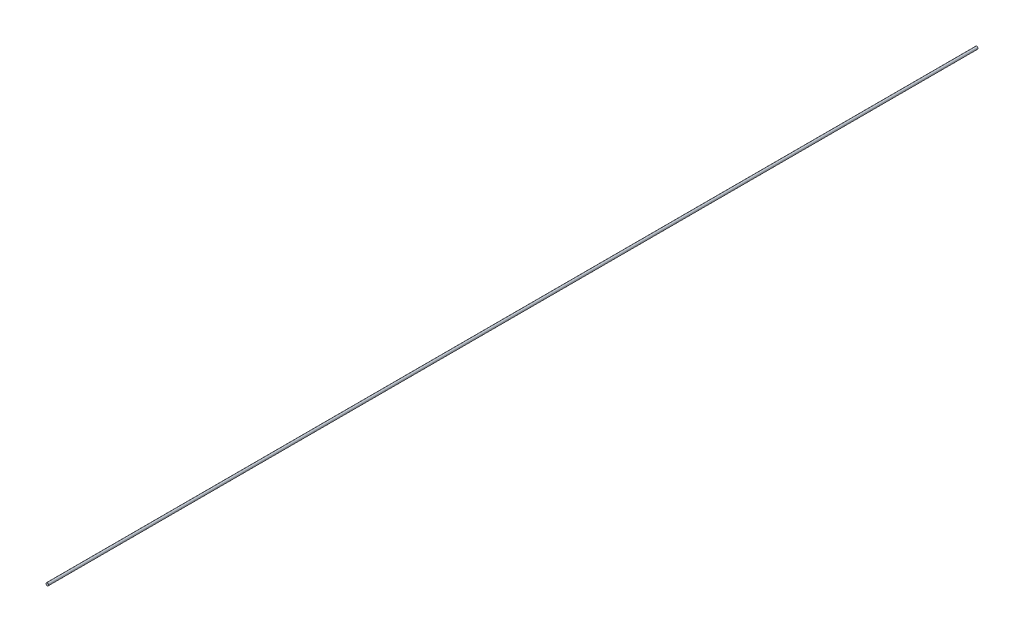
ISO-10303-21;
HEADER;
FILE_DESCRIPTION(('STEP AP214'),'2;1');
FILE_NAME('part.step','',(''),(''),'','','');
FILE_SCHEMA(('AUTOMOTIVE_DESIGN { 1 0 10303 214 1 1 1 1 }'));
ENDSEC;
DATA;
#1=APPLICATION_CONTEXT('core data for automotive mechanical design processes');
#2=APPLICATION_PROTOCOL_DEFINITION('international standard','automotive_design',2000,#1);
#3=PRODUCT_CONTEXT('',#1,'mechanical');
#4=PRODUCT('Part','Part','',(#3));
#5=PRODUCT_RELATED_PRODUCT_CATEGORY('part','',(#4));
#6=PRODUCT_DEFINITION_FORMATION('','',#4);
#7=PRODUCT_DEFINITION_CONTEXT('part definition',#1,'design');
#8=PRODUCT_DEFINITION('design','',#6,#7);
#9=PRODUCT_DEFINITION_SHAPE('','',#8);
#10=(LENGTH_UNIT() NAMED_UNIT(*) SI_UNIT(.MILLI.,.METRE.));
#11=(NAMED_UNIT(*) PLANE_ANGLE_UNIT() SI_UNIT($,.RADIAN.));
#12=(NAMED_UNIT(*) SI_UNIT($,.STERADIAN.) SOLID_ANGLE_UNIT());
#13=UNCERTAINTY_MEASURE_WITH_UNIT(LENGTH_MEASURE(1.E-05),#10,'distance_accuracy_value','');
#14=(GEOMETRIC_REPRESENTATION_CONTEXT(3) GLOBAL_UNCERTAINTY_ASSIGNED_CONTEXT((#13)) GLOBAL_UNIT_ASSIGNED_CONTEXT((#10,
#11,#12)) REPRESENTATION_CONTEXT('',''));
#15=CARTESIAN_POINT('',(0.,0.,0.));
#16=DIRECTION('',(0.,0.,1.));
#17=DIRECTION('',(1.,0.,0.));
#18=AXIS2_PLACEMENT_3D('',#15,#16,#17);
#19=CARTESIAN_POINT('',(0.,0.,1088.1));
#20=DIRECTION('',(0.,0.,-1.));
#21=DIRECTION('',(-1.,0.,0.));
#22=AXIS2_PLACEMENT_3D('',#19,#20,#21);
#23=CYLINDRICAL_SURFACE('',#22,1.5);
#24=CARTESIAN_POINT('',(0.,0.,1088.1));
#25=DIRECTION('',(0.,0.,1.));
#26=DIRECTION('',(1.,0.,0.));
#27=AXIS2_PLACEMENT_3D('',#24,#25,#26);
#28=CIRCLE('',#27,1.5);
#29=CARTESIAN_POINT('',(1.5,0.,1088.1));
#30=VERTEX_POINT('',#29);
#31=EDGE_CURVE('E10',#30,#30,#28,.T.);
#32=ORIENTED_EDGE('',*,*,#31,.F.);
#33=EDGE_LOOP('',(#32));
#34=FACE_BOUND('',#33,.T.);
#35=CARTESIAN_POINT('',(0.,0.,0.));
#36=DIRECTION('',(0.,0.,1.));
#37=DIRECTION('',(1.,0.,0.));
#38=AXIS2_PLACEMENT_3D('',#35,#36,#37);
#39=CIRCLE('',#38,1.5);
#40=CARTESIAN_POINT('',(1.5,0.,0.));
#41=VERTEX_POINT('',#40);
#42=EDGE_CURVE('E34',#41,#41,#39,.T.);
#43=ORIENTED_EDGE('',*,*,#42,.T.);
#44=EDGE_LOOP('',(#43));
#45=FACE_BOUND('',#44,.T.);
#46=ADVANCED_FACE('F31',(#34,#45),#23,.T.);
#47=CARTESIAN_POINT('',(0.,0.,1088.1));
#48=DIRECTION('',(0.,0.,1.));
#49=DIRECTION('',(1.,0.,0.));
#50=AXIS2_PLACEMENT_3D('',#47,#48,#49);
#51=PLANE('',#50);
#52=ORIENTED_EDGE('',*,*,#31,.T.);
#53=EDGE_LOOP('',(#52));
#54=FACE_BOUND('',#53,.T.);
#55=ADVANCED_FACE('F46',(#54),#51,.T.);
#56=CARTESIAN_POINT('',(0.,0.,0.));
#57=DIRECTION('',(0.,0.,1.));
#58=DIRECTION('',(1.,0.,0.));
#59=AXIS2_PLACEMENT_3D('',#56,#57,#58);
#60=PLANE('',#59);
#61=ORIENTED_EDGE('',*,*,#42,.F.);
#62=EDGE_LOOP('',(#61));
#63=FACE_BOUND('',#62,.T.);
#64=ADVANCED_FACE('F44',(#63),#60,.F.);
#65=CLOSED_SHELL('',(#46,#55,#64));
#66=MANIFOLD_SOLID_BREP('B2',#65);
#67=ADVANCED_BREP_SHAPE_REPRESENTATION('',(#18,#66),#14);
#68=SHAPE_DEFINITION_REPRESENTATION(#9,#67);
ENDSEC;
END-ISO-10303-21;
